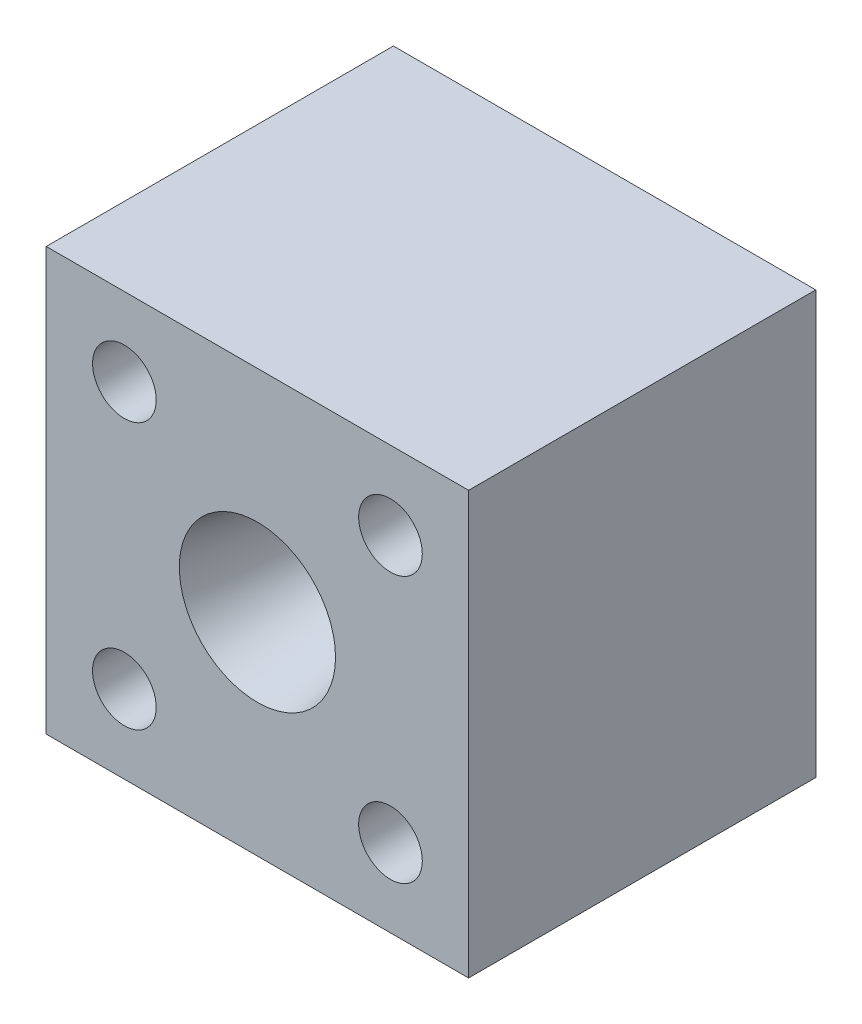
ISO-10303-21;
HEADER;
FILE_DESCRIPTION(('STEP AP214'),'2;1');
FILE_NAME('part.step','',(''),(''),'','','');
FILE_SCHEMA(('AUTOMOTIVE_DESIGN { 1 0 10303 214 1 1 1 1 }'));
ENDSEC;
DATA;
#1=APPLICATION_CONTEXT('core data for automotive mechanical design processes');
#2=APPLICATION_PROTOCOL_DEFINITION('international standard','automotive_design',2000,#1);
#3=PRODUCT_CONTEXT('',#1,'mechanical');
#4=PRODUCT('Part','Part','',(#3));
#5=PRODUCT_RELATED_PRODUCT_CATEGORY('part','',(#4));
#6=PRODUCT_DEFINITION_FORMATION('','',#4);
#7=PRODUCT_DEFINITION_CONTEXT('part definition',#1,'design');
#8=PRODUCT_DEFINITION('design','',#6,#7);
#9=PRODUCT_DEFINITION_SHAPE('','',#8);
#10=(LENGTH_UNIT() NAMED_UNIT(*) SI_UNIT(.MILLI.,.METRE.));
#11=(NAMED_UNIT(*) PLANE_ANGLE_UNIT() SI_UNIT($,.RADIAN.));
#12=(NAMED_UNIT(*) SI_UNIT($,.STERADIAN.) SOLID_ANGLE_UNIT());
#13=UNCERTAINTY_MEASURE_WITH_UNIT(LENGTH_MEASURE(1.E-05),#10,'distance_accuracy_value','');
#14=(GEOMETRIC_REPRESENTATION_CONTEXT(3) GLOBAL_UNCERTAINTY_ASSIGNED_CONTEXT((#13)) GLOBAL_UNIT_ASSIGNED_CONTEXT((#10,
#11,#12)) REPRESENTATION_CONTEXT('',''));
#15=CARTESIAN_POINT('',(0.,0.,0.));
#16=DIRECTION('',(0.,0.,1.));
#17=DIRECTION('',(1.,0.,0.));
#18=AXIS2_PLACEMENT_3D('',#15,#16,#17);
#19=CARTESIAN_POINT('',(-23.1775,23.1775,63.5));
#20=DIRECTION('',(1.,0.,0.));
#21=DIRECTION('',(0.,1.,0.));
#22=AXIS2_PLACEMENT_3D('',#19,#20,#21);
#23=PLANE('',#22);
#24=DIRECTION('',(0.,-1.,0.));
#25=VECTOR('',#24,1.);
#26=CARTESIAN_POINT('',(-23.1775,23.1775,38.1));
#27=LINE('',#26,#25);
#28=CARTESIAN_POINT('',(-23.1775,23.1775,38.1));
#29=VERTEX_POINT('',#28);
#30=CARTESIAN_POINT('',(-23.1775,-23.1775,38.1));
#31=VERTEX_POINT('',#30);
#32=EDGE_CURVE('E76',#29,#31,#27,.T.);
#33=ORIENTED_EDGE('',*,*,#32,.F.);
#34=DIRECTION('',(0.,0.,-1.));
#35=VECTOR('',#34,1.);
#36=CARTESIAN_POINT('',(-23.1775,23.1775,63.5));
#37=LINE('',#36,#35);
#38=CARTESIAN_POINT('',(-23.1775,23.1775,0.));
#39=VERTEX_POINT('',#38);
#40=EDGE_CURVE('E58',#29,#39,#37,.T.);
#41=ORIENTED_EDGE('',*,*,#40,.T.);
#42=DIRECTION('',(0.,-1.,0.));
#43=VECTOR('',#42,1.);
#44=CARTESIAN_POINT('',(-23.1775,23.1775,0.));
#45=LINE('',#44,#43);
#46=CARTESIAN_POINT('',(-23.1775,-23.1775,0.));
#47=VERTEX_POINT('',#46);
#48=EDGE_CURVE('E108',#39,#47,#45,.T.);
#49=ORIENTED_EDGE('',*,*,#48,.T.);
#50=DIRECTION('',(0.,0.,-1.));
#51=VECTOR('',#50,1.);
#52=CARTESIAN_POINT('',(-23.1775,-23.1775,63.5));
#53=LINE('',#52,#51);
#54=EDGE_CURVE('E12',#31,#47,#53,.T.);
#55=ORIENTED_EDGE('',*,*,#54,.F.);
#56=EDGE_LOOP('',(#33,#41,#49,#55));
#57=FACE_BOUND('',#56,.T.);
#58=ADVANCED_FACE('F35',(#57),#23,.F.);
#59=CARTESIAN_POINT('',(-23.1775,-23.1775,63.5));
#60=DIRECTION('',(0.,1.,0.));
#61=DIRECTION('',(0.,0.,1.));
#62=AXIS2_PLACEMENT_3D('',#59,#60,#61);
#63=PLANE('',#62);
#64=DIRECTION('',(1.,0.,0.));
#65=VECTOR('',#64,1.);
#66=CARTESIAN_POINT('',(-23.1775,-23.1775,38.1));
#67=LINE('',#66,#65);
#68=CARTESIAN_POINT('',(23.1775,-23.1775,38.1));
#69=VERTEX_POINT('',#68);
#70=EDGE_CURVE('E84',#31,#69,#67,.T.);
#71=ORIENTED_EDGE('',*,*,#70,.F.);
#72=ORIENTED_EDGE('',*,*,#54,.T.);
#73=DIRECTION('',(1.,0.,0.));
#74=VECTOR('',#73,1.);
#75=CARTESIAN_POINT('',(-23.1775,-23.1775,0.));
#76=LINE('',#75,#74);
#77=CARTESIAN_POINT('',(23.1775,-23.1775,0.));
#78=VERTEX_POINT('',#77);
#79=EDGE_CURVE('E105',#47,#78,#76,.T.);
#80=ORIENTED_EDGE('',*,*,#79,.T.);
#81=DIRECTION('',(0.,0.,-1.));
#82=VECTOR('',#81,1.);
#83=CARTESIAN_POINT('',(23.1775,-23.1775,63.5));
#84=LINE('',#83,#82);
#85=EDGE_CURVE('E43',#69,#78,#84,.T.);
#86=ORIENTED_EDGE('',*,*,#85,.F.);
#87=EDGE_LOOP('',(#71,#72,#80,#86));
#88=FACE_BOUND('',#87,.T.);
#89=ADVANCED_FACE('F106',(#88),#63,.F.);
#90=CARTESIAN_POINT('',(23.1775,23.1775,63.5));
#91=DIRECTION('',(-1.,0.,0.));
#92=DIRECTION('',(0.,-1.,0.));
#93=AXIS2_PLACEMENT_3D('',#90,#91,#92);
#94=PLANE('',#93);
#95=DIRECTION('',(0.,1.,0.));
#96=VECTOR('',#95,1.);
#97=CARTESIAN_POINT('',(23.1775,23.1775,38.1));
#98=LINE('',#97,#96);
#99=CARTESIAN_POINT('',(23.1775,23.1775,38.1));
#100=VERTEX_POINT('',#99);
#101=EDGE_CURVE('E50',#69,#100,#98,.T.);
#102=ORIENTED_EDGE('',*,*,#101,.F.);
#103=ORIENTED_EDGE('',*,*,#85,.T.);
#104=DIRECTION('',(0.,1.,0.));
#105=VECTOR('',#104,1.);
#106=CARTESIAN_POINT('',(23.1775,23.1775,0.));
#107=LINE('',#106,#105);
#108=CARTESIAN_POINT('',(23.1775,23.1775,0.));
#109=VERTEX_POINT('',#108);
#110=EDGE_CURVE('E93',#78,#109,#107,.T.);
#111=ORIENTED_EDGE('',*,*,#110,.T.);
#112=DIRECTION('',(0.,0.,-1.));
#113=VECTOR('',#112,1.);
#114=CARTESIAN_POINT('',(23.1775,23.1775,63.5));
#115=LINE('',#114,#113);
#116=EDGE_CURVE('E90',#100,#109,#115,.T.);
#117=ORIENTED_EDGE('',*,*,#116,.F.);
#118=EDGE_LOOP('',(#102,#103,#111,#117));
#119=FACE_BOUND('',#118,.T.);
#120=ADVANCED_FACE('F101',(#119),#94,.F.);
#121=CARTESIAN_POINT('',(-23.1775,23.1775,63.5));
#122=DIRECTION('',(0.,-1.,0.));
#123=DIRECTION('',(0.,0.,-1.));
#124=AXIS2_PLACEMENT_3D('',#121,#122,#123);
#125=PLANE('',#124);
#126=DIRECTION('',(-1.,0.,0.));
#127=VECTOR('',#126,1.);
#128=CARTESIAN_POINT('',(-23.1775,23.1775,38.1));
#129=LINE('',#128,#127);
#130=EDGE_CURVE('E74',#100,#29,#129,.T.);
#131=ORIENTED_EDGE('',*,*,#130,.F.);
#132=ORIENTED_EDGE('',*,*,#116,.T.);
#133=DIRECTION('',(-1.,0.,0.));
#134=VECTOR('',#133,1.);
#135=CARTESIAN_POINT('',(-23.1775,23.1775,0.));
#136=LINE('',#135,#134);
#137=EDGE_CURVE('E88',#109,#39,#136,.T.);
#138=ORIENTED_EDGE('',*,*,#137,.T.);
#139=ORIENTED_EDGE('',*,*,#40,.F.);
#140=EDGE_LOOP('',(#131,#132,#138,#139));
#141=FACE_BOUND('',#140,.T.);
#142=ADVANCED_FACE('F86',(#141),#125,.F.);
#143=CARTESIAN_POINT('',(14.6018964528584,14.6018964528585,0.));
#144=DIRECTION('',(0.,0.,1.));
#145=DIRECTION('',(1.,0.,0.));
#146=AXIS2_PLACEMENT_3D('',#143,#144,#145);
#147=CYLINDRICAL_SURFACE('',#146,3.4925);
#148=CARTESIAN_POINT('',(14.6018964528584,14.6018964528585,0.));
#149=DIRECTION('',(0.,0.,1.));
#150=DIRECTION('',(1.,0.,0.));
#151=AXIS2_PLACEMENT_3D('',#148,#149,#150);
#152=CIRCLE('',#151,3.4925);
#153=CARTESIAN_POINT('',(18.0943964528584,14.6018964528585,0.));
#154=VERTEX_POINT('',#153);
#155=EDGE_CURVE('E114',#154,#154,#152,.T.);
#156=ORIENTED_EDGE('',*,*,#155,.F.);
#157=EDGE_LOOP('',(#156));
#158=FACE_BOUND('',#157,.T.);
#159=CARTESIAN_POINT('',(14.6018964528584,14.6018964528585,38.1));
#160=DIRECTION('',(0.,0.,1.));
#161=DIRECTION('',(1.,0.,0.));
#162=AXIS2_PLACEMENT_3D('',#159,#160,#161);
#163=CIRCLE('',#162,3.4925);
#164=CARTESIAN_POINT('',(18.0943964528584,14.6018964528585,38.1));
#165=VERTEX_POINT('',#164);
#166=EDGE_CURVE('E80',#165,#165,#163,.F.);
#167=ORIENTED_EDGE('',*,*,#166,.F.);
#168=EDGE_LOOP('',(#167));
#169=FACE_BOUND('',#168,.T.);
#170=ADVANCED_FACE('F172',(#158,#169),#147,.F.);
#171=CARTESIAN_POINT('',(14.6018964528584,-14.6018964528585,0.));
#172=DIRECTION('',(0.,0.,1.));
#173=DIRECTION('',(1.,0.,0.));
#174=AXIS2_PLACEMENT_3D('',#171,#172,#173);
#175=CYLINDRICAL_SURFACE('',#174,3.4925);
#176=CARTESIAN_POINT('',(14.6018964528584,-14.6018964528585,0.));
#177=DIRECTION('',(0.,0.,-1.));
#178=DIRECTION('',(1.,0.,0.));
#179=AXIS2_PLACEMENT_3D('',#176,#177,#178);
#180=CIRCLE('',#179,3.4925);
#181=CARTESIAN_POINT('',(18.0943964528584,-14.6018964528585,0.));
#182=VERTEX_POINT('',#181);
#183=EDGE_CURVE('E117',#182,#182,#180,.T.);
#184=ORIENTED_EDGE('',*,*,#183,.T.);
#185=EDGE_LOOP('',(#184));
#186=FACE_BOUND('',#185,.T.);
#187=CARTESIAN_POINT('',(14.6018964528584,-14.6018964528585,38.1));
#188=DIRECTION('',(0.,0.,1.));
#189=DIRECTION('',(1.,0.,0.));
#190=AXIS2_PLACEMENT_3D('',#187,#188,#189);
#191=CIRCLE('',#190,3.4925);
#192=CARTESIAN_POINT('',(18.0943964528584,-14.6018964528585,38.1));
#193=VERTEX_POINT('',#192);
#194=EDGE_CURVE('E132',#193,#193,#191,.T.);
#195=ORIENTED_EDGE('',*,*,#194,.T.);
#196=EDGE_LOOP('',(#195));
#197=FACE_BOUND('',#196,.T.);
#198=ADVANCED_FACE('F176',(#186,#197),#175,.F.);
#199=CARTESIAN_POINT('',(-14.6018964528584,-14.6018964528585,0.));
#200=DIRECTION('',(0.,0.,1.));
#201=DIRECTION('',(1.,0.,0.));
#202=AXIS2_PLACEMENT_3D('',#199,#200,#201);
#203=CYLINDRICAL_SURFACE('',#202,3.4925);
#204=CARTESIAN_POINT('',(-14.6018964528584,-14.6018964528585,0.));
#205=DIRECTION('',(0.,0.,1.));
#206=DIRECTION('',(-1.,0.,0.));
#207=AXIS2_PLACEMENT_3D('',#204,#205,#206);
#208=CIRCLE('',#207,3.4925);
#209=CARTESIAN_POINT('',(-18.0943964528584,-14.6018964528585,0.));
#210=VERTEX_POINT('',#209);
#211=EDGE_CURVE('E120',#210,#210,#208,.T.);
#212=ORIENTED_EDGE('',*,*,#211,.F.);
#213=EDGE_LOOP('',(#212));
#214=FACE_BOUND('',#213,.T.);
#215=CARTESIAN_POINT('',(-14.6018964528584,-14.6018964528585,38.1));
#216=DIRECTION('',(0.,0.,1.));
#217=DIRECTION('',(1.,0.,0.));
#218=AXIS2_PLACEMENT_3D('',#215,#216,#217);
#219=CIRCLE('',#218,3.4925);
#220=CARTESIAN_POINT('',(-11.1093964528584,-14.6018964528585,38.1));
#221=VERTEX_POINT('',#220);
#222=EDGE_CURVE('E135',#221,#221,#219,.F.);
#223=ORIENTED_EDGE('',*,*,#222,.F.);
#224=EDGE_LOOP('',(#223));
#225=FACE_BOUND('',#224,.T.);
#226=ADVANCED_FACE('F158',(#214,#225),#203,.F.);
#227=CARTESIAN_POINT('',(-14.6018964528584,14.6018964528585,0.));
#228=DIRECTION('',(0.,0.,1.));
#229=DIRECTION('',(1.,0.,0.));
#230=AXIS2_PLACEMENT_3D('',#227,#228,#229);
#231=CYLINDRICAL_SURFACE('',#230,3.4925);
#232=CARTESIAN_POINT('',(-14.6018964528584,14.6018964528585,0.));
#233=DIRECTION('',(0.,0.,-1.));
#234=DIRECTION('',(-1.,0.,0.));
#235=AXIS2_PLACEMENT_3D('',#232,#233,#234);
#236=CIRCLE('',#235,3.4925);
#237=CARTESIAN_POINT('',(-18.0943964528584,14.6018964528585,0.));
#238=VERTEX_POINT('',#237);
#239=EDGE_CURVE('E123',#238,#238,#236,.T.);
#240=ORIENTED_EDGE('',*,*,#239,.T.);
#241=EDGE_LOOP('',(#240));
#242=FACE_BOUND('',#241,.T.);
#243=CARTESIAN_POINT('',(-14.6018964528584,14.6018964528585,38.1));
#244=DIRECTION('',(0.,0.,1.));
#245=DIRECTION('',(1.,0.,0.));
#246=AXIS2_PLACEMENT_3D('',#243,#244,#245);
#247=CIRCLE('',#246,3.4925);
#248=CARTESIAN_POINT('',(-11.1093964528584,14.6018964528585,38.1));
#249=VERTEX_POINT('',#248);
#250=EDGE_CURVE('E138',#249,#249,#247,.T.);
#251=ORIENTED_EDGE('',*,*,#250,.T.);
#252=EDGE_LOOP('',(#251));
#253=FACE_BOUND('',#252,.T.);
#254=ADVANCED_FACE('F149',(#242,#253),#231,.F.);
#255=CARTESIAN_POINT('',(0.,0.,0.));
#256=DIRECTION('',(0.,0.,1.));
#257=DIRECTION('',(0.,-1.,0.));
#258=AXIS2_PLACEMENT_3D('',#255,#256,#257);
#259=CONICAL_SURFACE('',#258,1.27,0.18935217210315);
#260=CARTESIAN_POINT('',(0.,0.,0.));
#261=DIRECTION('',(0.,0.,-1.));
#262=DIRECTION('',(0.,1.,0.));
#263=AXIS2_PLACEMENT_3D('',#260,#261,#262);
#264=CIRCLE('',#263,1.27);
#265=CARTESIAN_POINT('',(0.,1.27,0.));
#266=VERTEX_POINT('',#265);
#267=EDGE_CURVE('E83',#266,#266,#264,.T.);
#268=ORIENTED_EDGE('',*,*,#267,.T.);
#269=EDGE_LOOP('',(#268));
#270=FACE_BOUND('',#269,.T.);
#271=CARTESIAN_POINT('',(0.,0.,38.1));
#272=DIRECTION('',(0.,0.,1.));
#273=DIRECTION('',(1.,0.,0.));
#274=AXIS2_PLACEMENT_3D('',#271,#272,#273);
#275=CIRCLE('',#274,8.57179383278);
#276=CARTESIAN_POINT('',(8.57179383278,0.,38.1));
#277=VERTEX_POINT('',#276);
#278=EDGE_CURVE('E38',#277,#277,#275,.F.);
#279=ORIENTED_EDGE('',*,*,#278,.F.);
#280=EDGE_LOOP('',(#279));
#281=FACE_BOUND('',#280,.T.);
#282=ADVANCED_FACE('F147',(#270,#281),#259,.F.);
#283=CARTESIAN_POINT('',(0.,0.,0.));
#284=DIRECTION('',(0.,0.,1.));
#285=DIRECTION('',(1.,0.,0.));
#286=AXIS2_PLACEMENT_3D('',#283,#284,#285);
#287=PLANE('',#286);
#288=ORIENTED_EDGE('',*,*,#211,.T.);
#289=EDGE_LOOP('',(#288));
#290=FACE_BOUND('',#289,.T.);
#291=ORIENTED_EDGE('',*,*,#155,.T.);
#292=EDGE_LOOP('',(#291));
#293=FACE_BOUND('',#292,.T.);
#294=ORIENTED_EDGE('',*,*,#267,.F.);
#295=EDGE_LOOP('',(#294));
#296=FACE_BOUND('',#295,.T.);
#297=ORIENTED_EDGE('',*,*,#48,.F.);
#298=ORIENTED_EDGE('',*,*,#137,.F.);
#299=ORIENTED_EDGE('',*,*,#110,.F.);
#300=ORIENTED_EDGE('',*,*,#79,.F.);
#301=EDGE_LOOP('',(#297,#298,#299,#300));
#302=FACE_BOUND('',#301,.T.);
#303=ORIENTED_EDGE('',*,*,#183,.F.);
#304=EDGE_LOOP('',(#303));
#305=FACE_BOUND('',#304,.T.);
#306=ORIENTED_EDGE('',*,*,#239,.F.);
#307=EDGE_LOOP('',(#306));
#308=FACE_BOUND('',#307,.T.);
#309=ADVANCED_FACE('F110',(#290,#293,#296,#302,#305,#308),#287,.F.);
#310=CARTESIAN_POINT('',(0.,0.,38.1));
#311=DIRECTION('',(0.,0.,1.));
#312=DIRECTION('',(1.,0.,0.));
#313=AXIS2_PLACEMENT_3D('',#310,#311,#312);
#314=PLANE('',#313);
#315=ORIENTED_EDGE('',*,*,#166,.T.);
#316=EDGE_LOOP('',(#315));
#317=FACE_BOUND('',#316,.T.);
#318=ORIENTED_EDGE('',*,*,#222,.T.);
#319=EDGE_LOOP('',(#318));
#320=FACE_BOUND('',#319,.T.);
#321=ORIENTED_EDGE('',*,*,#278,.T.);
#322=EDGE_LOOP('',(#321));
#323=FACE_BOUND('',#322,.T.);
#324=ORIENTED_EDGE('',*,*,#250,.F.);
#325=EDGE_LOOP('',(#324));
#326=FACE_BOUND('',#325,.T.);
#327=ORIENTED_EDGE('',*,*,#194,.F.);
#328=EDGE_LOOP('',(#327));
#329=FACE_BOUND('',#328,.T.);
#330=ORIENTED_EDGE('',*,*,#32,.T.);
#331=ORIENTED_EDGE('',*,*,#70,.T.);
#332=ORIENTED_EDGE('',*,*,#101,.T.);
#333=ORIENTED_EDGE('',*,*,#130,.T.);
#334=EDGE_LOOP('',(#330,#331,#332,#333));
#335=FACE_BOUND('',#334,.T.);
#336=ADVANCED_FACE('F75',(#317,#320,#323,#326,#329,#335),#314,.T.);
#337=CLOSED_SHELL('',(#58,#89,#120,#142,#170,#198,#226,#254,#282,#309,#336));
#338=MANIFOLD_SOLID_BREP('B2',#337);
#339=ADVANCED_BREP_SHAPE_REPRESENTATION('',(#18,#338),#14);
#340=SHAPE_DEFINITION_REPRESENTATION(#9,#339);
ENDSEC;
END-ISO-10303-21;
